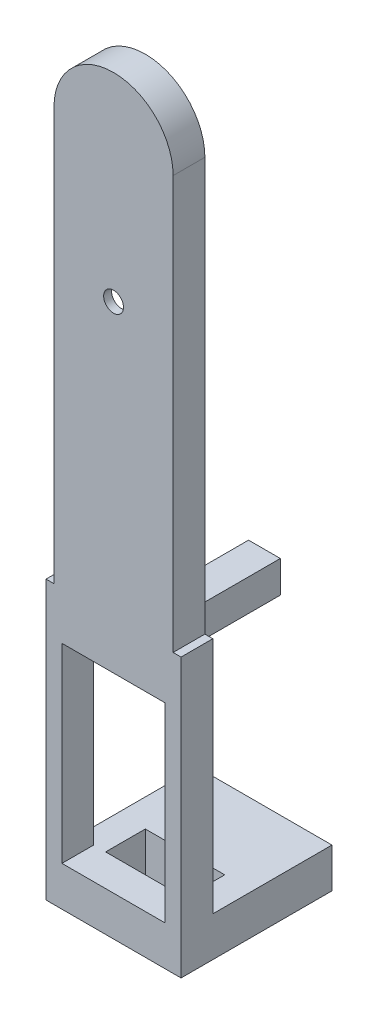
ISO-10303-21;
HEADER;
FILE_DESCRIPTION(('STEP AP214'),'2;1');
FILE_NAME('part.step','',(''),(''),'','','');
FILE_SCHEMA(('AUTOMOTIVE_DESIGN { 1 0 10303 214 1 1 1 1 }'));
ENDSEC;
DATA;
#1=APPLICATION_CONTEXT('core data for automotive mechanical design processes');
#2=APPLICATION_PROTOCOL_DEFINITION('international standard','automotive_design',2000,#1);
#3=PRODUCT_CONTEXT('',#1,'mechanical');
#4=PRODUCT('Part','Part','',(#3));
#5=PRODUCT_RELATED_PRODUCT_CATEGORY('part','',(#4));
#6=PRODUCT_DEFINITION_FORMATION('','',#4);
#7=PRODUCT_DEFINITION_CONTEXT('part definition',#1,'design');
#8=PRODUCT_DEFINITION('design','',#6,#7);
#9=PRODUCT_DEFINITION_SHAPE('','',#8);
#10=(LENGTH_UNIT() NAMED_UNIT(*) SI_UNIT(.MILLI.,.METRE.));
#11=(NAMED_UNIT(*) PLANE_ANGLE_UNIT() SI_UNIT($,.RADIAN.));
#12=(NAMED_UNIT(*) SI_UNIT($,.STERADIAN.) SOLID_ANGLE_UNIT());
#13=UNCERTAINTY_MEASURE_WITH_UNIT(LENGTH_MEASURE(1.E-05),#10,'distance_accuracy_value','');
#14=(GEOMETRIC_REPRESENTATION_CONTEXT(3) GLOBAL_UNCERTAINTY_ASSIGNED_CONTEXT((#13)) GLOBAL_UNIT_ASSIGNED_CONTEXT((#10,
#11,#12)) REPRESENTATION_CONTEXT('',''));
#15=CARTESIAN_POINT('',(0.,0.,0.));
#16=DIRECTION('',(0.,0.,1.));
#17=DIRECTION('',(1.,0.,0.));
#18=AXIS2_PLACEMENT_3D('',#15,#16,#17);
#19=CARTESIAN_POINT('',(0.,52.,0.));
#20=DIRECTION('',(0.,0.,1.));
#21=DIRECTION('',(1.,0.,0.));
#22=AXIS2_PLACEMENT_3D('',#19,#20,#21);
#23=PLANE('',#22);
#24=DIRECTION('',(1.,0.,0.));
#25=VECTOR('',#24,1.);
#26=CARTESIAN_POINT('',(-6.49999999999999,-30.,0.));
#27=LINE('',#26,#25);
#28=CARTESIAN_POINT('',(-5.,-30.,0.));
#29=VERTEX_POINT('',#28);
#30=CARTESIAN_POINT('',(5.,-30.,0.));
#31=VERTEX_POINT('',#30);
#32=EDGE_CURVE('E354',#29,#31,#27,.T.);
#33=ORIENTED_EDGE('',*,*,#32,.T.);
#34=DIRECTION('',(0.,-1.,0.));
#35=VECTOR('',#34,1.);
#36=CARTESIAN_POINT('',(5.,-30.,0.));
#37=LINE('',#36,#35);
#38=CARTESIAN_POINT('',(5.,-35.,0.));
#39=VERTEX_POINT('',#38);
#40=EDGE_CURVE('E254',#31,#39,#37,.T.);
#41=ORIENTED_EDGE('',*,*,#40,.T.);
#42=DIRECTION('',(1.,0.,0.));
#43=VECTOR('',#42,1.);
#44=CARTESIAN_POINT('',(8.50000000000001,-35.,0.));
#45=LINE('',#44,#43);
#46=CARTESIAN_POINT('',(-5.,-35.,0.));
#47=VERTEX_POINT('',#46);
#48=EDGE_CURVE('E401',#47,#39,#45,.T.);
#49=ORIENTED_EDGE('',*,*,#48,.F.);
#50=DIRECTION('',(0.,-1.,0.));
#51=VECTOR('',#50,1.);
#52=CARTESIAN_POINT('',(-5.,-30.,0.));
#53=LINE('',#52,#51);
#54=EDGE_CURVE('E294',#29,#47,#53,.T.);
#55=ORIENTED_EDGE('',*,*,#54,.F.);
#56=EDGE_LOOP('',(#33,#41,#49,#55));
#57=FACE_BOUND('',#56,.T.);
#58=ADVANCED_FACE('F41',(#57),#23,.F.);
#59=CARTESIAN_POINT('',(0.,52.,4.));
#60=DIRECTION('',(0.,0.,1.));
#61=DIRECTION('',(1.,0.,0.));
#62=AXIS2_PLACEMENT_3D('',#59,#60,#61);
#63=PLANE('',#62);
#64=CARTESIAN_POINT('',(0.,34.5,4.));
#65=DIRECTION('',(0.,0.,1.));
#66=DIRECTION('',(1.,0.,0.));
#67=AXIS2_PLACEMENT_3D('',#64,#65,#66);
#68=CIRCLE('',#67,1.25);
#69=CARTESIAN_POINT('',(1.25,34.5,4.));
#70=VERTEX_POINT('',#69);
#71=EDGE_CURVE('E439',#70,#70,#68,.F.);
#72=ORIENTED_EDGE('',*,*,#71,.T.);
#73=EDGE_LOOP('',(#72));
#74=FACE_BOUND('',#73,.T.);
#75=DIRECTION('',(0.,-1.,0.));
#76=VECTOR('',#75,1.);
#77=CARTESIAN_POINT('',(-7.5,0.,4.));
#78=LINE('',#77,#76);
#79=CARTESIAN_POINT('',(-7.5,52.,4.));
#80=VERTEX_POINT('',#79);
#81=CARTESIAN_POINT('',(-7.5,0.,4.));
#82=VERTEX_POINT('',#81);
#83=EDGE_CURVE('E513',#80,#82,#78,.T.);
#84=ORIENTED_EDGE('',*,*,#83,.T.);
#85=DIRECTION('',(-1.,0.,0.));
#86=VECTOR('',#85,1.);
#87=CARTESIAN_POINT('',(8.50000000000001,0.,4.));
#88=LINE('',#87,#86);
#89=CARTESIAN_POINT('',(-8.49999999999999,0.,4.));
#90=VERTEX_POINT('',#89);
#91=EDGE_CURVE('E400',#82,#90,#88,.T.);
#92=ORIENTED_EDGE('',*,*,#91,.T.);
#93=DIRECTION('',(0.,-1.,0.));
#94=VECTOR('',#93,1.);
#95=CARTESIAN_POINT('',(-8.49999999999999,0.,4.));
#96=LINE('',#95,#94);
#97=CARTESIAN_POINT('',(-8.49999999999999,-35.,4.));
#98=VERTEX_POINT('',#97);
#99=EDGE_CURVE('E406',#90,#98,#96,.T.);
#100=ORIENTED_EDGE('',*,*,#99,.T.);
#101=DIRECTION('',(1.,0.,0.));
#102=VECTOR('',#101,1.);
#103=CARTESIAN_POINT('',(8.50000000000001,-35.,4.));
#104=LINE('',#103,#102);
#105=CARTESIAN_POINT('',(8.50000000000001,-35.,4.));
#106=VERTEX_POINT('',#105);
#107=EDGE_CURVE('E409',#98,#106,#104,.T.);
#108=ORIENTED_EDGE('',*,*,#107,.T.);
#109=DIRECTION('',(0.,1.,0.));
#110=VECTOR('',#109,1.);
#111=CARTESIAN_POINT('',(8.50000000000001,0.,4.));
#112=LINE('',#111,#110);
#113=CARTESIAN_POINT('',(8.50000000000001,0.,4.));
#114=VERTEX_POINT('',#113);
#115=EDGE_CURVE('E396',#106,#114,#112,.T.);
#116=ORIENTED_EDGE('',*,*,#115,.T.);
#117=CARTESIAN_POINT('',(7.5,0.,4.));
#118=VERTEX_POINT('',#117);
#119=EDGE_CURVE('E402',#114,#118,#88,.T.);
#120=ORIENTED_EDGE('',*,*,#119,.T.);
#121=DIRECTION('',(0.,1.,0.));
#122=VECTOR('',#121,1.);
#123=CARTESIAN_POINT('',(7.5,0.,4.));
#124=LINE('',#123,#122);
#125=CARTESIAN_POINT('',(7.5,52.,4.));
#126=VERTEX_POINT('',#125);
#127=EDGE_CURVE('E506',#118,#126,#124,.T.);
#128=ORIENTED_EDGE('',*,*,#127,.T.);
#129=CARTESIAN_POINT('',(0.,52.,4.));
#130=DIRECTION('',(0.,0.,1.));
#131=DIRECTION('',(1.,0.,0.));
#132=AXIS2_PLACEMENT_3D('',#129,#130,#131);
#133=CIRCLE('',#132,7.5);
#134=EDGE_CURVE('E509',#126,#80,#133,.T.);
#135=ORIENTED_EDGE('',*,*,#134,.T.);
#136=EDGE_LOOP('',(#84,#92,#100,#108,#116,#120,#128,#135));
#137=FACE_BOUND('',#136,.T.);
#138=DIRECTION('',(-1.,0.,0.));
#139=VECTOR('',#138,1.);
#140=CARTESIAN_POINT('',(0.,-30.,4.));
#141=LINE('',#140,#139);
#142=CARTESIAN_POINT('',(6.50000000000001,-30.,4.));
#143=VERTEX_POINT('',#142);
#144=CARTESIAN_POINT('',(-6.49999999999999,-30.,4.));
#145=VERTEX_POINT('',#144);
#146=EDGE_CURVE('E388',#143,#145,#141,.T.);
#147=ORIENTED_EDGE('',*,*,#146,.T.);
#148=DIRECTION('',(0.,1.,0.));
#149=VECTOR('',#148,1.);
#150=CARTESIAN_POINT('',(-6.5,52.,4.));
#151=LINE('',#150,#149);
#152=CARTESIAN_POINT('',(-6.49999999999999,-6.,4.));
#153=VERTEX_POINT('',#152);
#154=EDGE_CURVE('E392',#145,#153,#151,.T.);
#155=ORIENTED_EDGE('',*,*,#154,.T.);
#156=DIRECTION('',(1.,0.,0.));
#157=VECTOR('',#156,1.);
#158=CARTESIAN_POINT('',(0.,-6.,4.));
#159=LINE('',#158,#157);
#160=CARTESIAN_POINT('',(6.50000000000001,-6.,4.));
#161=VERTEX_POINT('',#160);
#162=EDGE_CURVE('E380',#153,#161,#159,.T.);
#163=ORIENTED_EDGE('',*,*,#162,.T.);
#164=DIRECTION('',(0.,-1.,0.));
#165=VECTOR('',#164,1.);
#166=CARTESIAN_POINT('',(6.5,52.,4.));
#167=LINE('',#166,#165);
#168=EDGE_CURVE('E384',#161,#143,#167,.T.);
#169=ORIENTED_EDGE('',*,*,#168,.T.);
#170=EDGE_LOOP('',(#147,#155,#163,#169));
#171=FACE_BOUND('',#170,.T.);
#172=ADVANCED_FACE('F556',(#74,#137,#171),#63,.T.);
#173=DIRECTION('',(-0.161684528353418,0.986842496699009,0.));
#174=VECTOR('',#173,1.);
#175=CARTESIAN_POINT('',(10.3740127119628,1.69968090964537,0.));
#176=LINE('',#175,#174);
#177=CARTESIAN_POINT('',(5.,34.5,0.));
#178=VERTEX_POINT('',#177);
#179=CARTESIAN_POINT('',(2.13279550115704,52.,0.));
#180=VERTEX_POINT('',#179);
#181=EDGE_CURVE('E449',#178,#180,#176,.T.);
#182=ORIENTED_EDGE('',*,*,#181,.T.);
#183=CARTESIAN_POINT('',(0.,52.,0.));
#184=DIRECTION('',(0.,0.,1.));
#185=DIRECTION('',(1.,0.,0.));
#186=AXIS2_PLACEMENT_3D('',#183,#184,#185);
#187=CIRCLE('',#186,2.13279550115703);
#188=CARTESIAN_POINT('',(-2.13279550115703,52.,0.));
#189=VERTEX_POINT('',#188);
#190=EDGE_CURVE('E443',#189,#180,#187,.F.);
#191=ORIENTED_EDGE('',*,*,#190,.F.);
#192=DIRECTION('',(-0.161684528353418,-0.986842496699009,0.));
#193=VECTOR('',#192,1.);
#194=CARTESIAN_POINT('',(-10.3740127119628,1.69968090964537,0.));
#195=LINE('',#194,#193);
#196=CARTESIAN_POINT('',(-5.,34.5,0.));
#197=VERTEX_POINT('',#196);
#198=EDGE_CURVE('E468',#189,#197,#195,.T.);
#199=ORIENTED_EDGE('',*,*,#198,.T.);
#200=DIRECTION('',(0.161167236733303,-0.986927110684346,0.));
#201=VECTOR('',#200,1.);
#202=CARTESIAN_POINT('',(0.617455268354402,0.100831721339679,0.));
#203=LINE('',#202,#201);
#204=CARTESIAN_POINT('',(-2.14221383494361,17.,0.));
#205=VERTEX_POINT('',#204);
#206=EDGE_CURVE('E472',#197,#205,#203,.T.);
#207=ORIENTED_EDGE('',*,*,#206,.T.);
#208=CARTESIAN_POINT('',(0.,17.,0.));
#209=DIRECTION('',(0.,0.,1.));
#210=DIRECTION('',(1.,0.,0.));
#211=AXIS2_PLACEMENT_3D('',#208,#209,#210);
#212=CIRCLE('',#211,2.14221383494361);
#213=CARTESIAN_POINT('',(2.11474128897981,16.6580213525557,0.));
#214=VERTEX_POINT('',#213);
#215=EDGE_CURVE('E476',#205,#214,#212,.T.);
#216=ORIENTED_EDGE('',*,*,#215,.T.);
#217=DIRECTION('',(-0.159637960443524,-0.987175628541057,0.));
#218=VECTOR('',#217,1.);
#219=CARTESIAN_POINT('',(-0.564300677997616,0.091254085603361,0.));
#220=LINE('',#219,#218);
#221=EDGE_CURVE('E480',#178,#214,#220,.T.);
#222=ORIENTED_EDGE('',*,*,#221,.F.);
#223=EDGE_LOOP('',(#182,#191,#199,#207,#216,#222));
#224=FACE_BOUND('',#223,.T.);
#225=DIRECTION('',(0.,1.,0.));
#226=VECTOR('',#225,1.);
#227=CARTESIAN_POINT('',(8.50000000000001,0.,0.));
#228=LINE('',#227,#226);
#229=CARTESIAN_POINT('',(8.50000000000001,-30.,0.));
#230=VERTEX_POINT('',#229);
#231=CARTESIAN_POINT('',(8.50000000000001,0.,0.));
#232=VERTEX_POINT('',#231);
#233=EDGE_CURVE('E59',#230,#232,#228,.T.);
#234=ORIENTED_EDGE('',*,*,#233,.F.);
#235=DIRECTION('',(1.,0.,0.));
#236=VECTOR('',#235,1.);
#237=CARTESIAN_POINT('',(0.,-30.,0.));
#238=LINE('',#237,#236);
#239=CARTESIAN_POINT('',(6.50000000000001,-30.,0.));
#240=VERTEX_POINT('',#239);
#241=EDGE_CURVE('E259',#240,#230,#238,.T.);
#242=ORIENTED_EDGE('',*,*,#241,.F.);
#243=DIRECTION('',(0.,1.,0.));
#244=VECTOR('',#243,1.);
#245=CARTESIAN_POINT('',(6.50000000000001,-6.,0.));
#246=LINE('',#245,#244);
#247=CARTESIAN_POINT('',(6.50000000000001,-6.,0.));
#248=VERTEX_POINT('',#247);
#249=EDGE_CURVE('E357',#240,#248,#246,.T.);
#250=ORIENTED_EDGE('',*,*,#249,.T.);
#251=DIRECTION('',(-1.,0.,0.));
#252=VECTOR('',#251,1.);
#253=CARTESIAN_POINT('',(-6.49999999999999,-6.,0.));
#254=LINE('',#253,#252);
#255=CARTESIAN_POINT('',(2.00000000000001,-6.00000000000001,0.));
#256=VERTEX_POINT('',#255);
#257=EDGE_CURVE('E362',#248,#256,#254,.T.);
#258=ORIENTED_EDGE('',*,*,#257,.T.);
#259=DIRECTION('',(0.,1.,0.));
#260=VECTOR('',#259,1.);
#261=CARTESIAN_POINT('',(2.00000000000001,-2.00000000000001,0.));
#262=LINE('',#261,#260);
#263=CARTESIAN_POINT('',(2.00000000000001,-2.00000000000001,0.));
#264=VERTEX_POINT('',#263);
#265=EDGE_CURVE('E310',#256,#264,#262,.T.);
#266=ORIENTED_EDGE('',*,*,#265,.T.);
#267=DIRECTION('',(-1.,0.,0.));
#268=VECTOR('',#267,1.);
#269=CARTESIAN_POINT('',(2.00000000000001,-2.00000000000001,0.));
#270=LINE('',#269,#268);
#271=CARTESIAN_POINT('',(-1.99999999999999,-2.00000000000001,0.));
#272=VERTEX_POINT('',#271);
#273=EDGE_CURVE('E333',#264,#272,#270,.T.);
#274=ORIENTED_EDGE('',*,*,#273,.T.);
#275=DIRECTION('',(0.,-1.,0.));
#276=VECTOR('',#275,1.);
#277=CARTESIAN_POINT('',(-1.99999999999999,-2.00000000000001,0.));
#278=LINE('',#277,#276);
#279=CARTESIAN_POINT('',(-1.99999999999999,-6.,0.));
#280=VERTEX_POINT('',#279);
#281=EDGE_CURVE('E317',#272,#280,#278,.T.);
#282=ORIENTED_EDGE('',*,*,#281,.T.);
#283=CARTESIAN_POINT('',(-6.49999999999999,-6.,0.));
#284=VERTEX_POINT('',#283);
#285=EDGE_CURVE('E361',#280,#284,#254,.T.);
#286=ORIENTED_EDGE('',*,*,#285,.T.);
#287=DIRECTION('',(0.,-1.,0.));
#288=VECTOR('',#287,1.);
#289=CARTESIAN_POINT('',(-6.49999999999999,-6.,0.));
#290=LINE('',#289,#288);
#291=CARTESIAN_POINT('',(-6.49999999999999,-30.,0.));
#292=VERTEX_POINT('',#291);
#293=EDGE_CURVE('E343',#284,#292,#290,.T.);
#294=ORIENTED_EDGE('',*,*,#293,.T.);
#295=DIRECTION('',(1.,0.,0.));
#296=VECTOR('',#295,1.);
#297=CARTESIAN_POINT('',(0.,-30.,0.));
#298=LINE('',#297,#296);
#299=CARTESIAN_POINT('',(-8.49999999999999,-30.,0.));
#300=VERTEX_POINT('',#299);
#301=EDGE_CURVE('E66',#300,#292,#298,.T.);
#302=ORIENTED_EDGE('',*,*,#301,.F.);
#303=DIRECTION('',(0.,-1.,0.));
#304=VECTOR('',#303,1.);
#305=CARTESIAN_POINT('',(-8.49999999999999,0.,0.));
#306=LINE('',#305,#304);
#307=CARTESIAN_POINT('',(-8.49999999999999,0.,0.));
#308=VERTEX_POINT('',#307);
#309=EDGE_CURVE('E420',#308,#300,#306,.T.);
#310=ORIENTED_EDGE('',*,*,#309,.F.);
#311=DIRECTION('',(-1.,0.,0.));
#312=VECTOR('',#311,1.);
#313=CARTESIAN_POINT('',(8.50000000000001,0.,0.));
#314=LINE('',#313,#312);
#315=CARTESIAN_POINT('',(-7.5,0.,0.));
#316=VERTEX_POINT('',#315);
#317=EDGE_CURVE('E415',#316,#308,#314,.T.);
#318=ORIENTED_EDGE('',*,*,#317,.F.);
#319=DIRECTION('',(0.,-1.,0.));
#320=VECTOR('',#319,1.);
#321=CARTESIAN_POINT('',(-7.5,0.,0.));
#322=LINE('',#321,#320);
#323=CARTESIAN_POINT('',(-7.5,52.,0.));
#324=VERTEX_POINT('',#323);
#325=EDGE_CURVE('E510',#324,#316,#322,.T.);
#326=ORIENTED_EDGE('',*,*,#325,.F.);
#327=CARTESIAN_POINT('',(0.,52.,0.));
#328=DIRECTION('',(0.,0.,1.));
#329=DIRECTION('',(1.,0.,0.));
#330=AXIS2_PLACEMENT_3D('',#327,#328,#329);
#331=CIRCLE('',#330,7.5);
#332=CARTESIAN_POINT('',(7.5,52.,0.));
#333=VERTEX_POINT('',#332);
#334=EDGE_CURVE('E519',#333,#324,#331,.T.);
#335=ORIENTED_EDGE('',*,*,#334,.F.);
#336=DIRECTION('',(0.,1.,0.));
#337=VECTOR('',#336,1.);
#338=CARTESIAN_POINT('',(7.5,0.,0.));
#339=LINE('',#338,#337);
#340=CARTESIAN_POINT('',(7.5,0.,0.));
#341=VERTEX_POINT('',#340);
#342=EDGE_CURVE('E505',#341,#333,#339,.T.);
#343=ORIENTED_EDGE('',*,*,#342,.F.);
#344=EDGE_CURVE('E416',#232,#341,#314,.T.);
#345=ORIENTED_EDGE('',*,*,#344,.F.);
#346=EDGE_LOOP('',(#234,#242,#250,#258,#266,#274,#282,#286,#294,#302,#310,#318,#326,#335,#343,#345));
#347=FACE_BOUND('',#346,.T.);
#348=ADVANCED_FACE('F542',(#224,#347),#23,.F.);
#349=CARTESIAN_POINT('',(7.5,0.,4.));
#350=DIRECTION('',(-1.,0.,0.));
#351=DIRECTION('',(0.,0.,1.));
#352=AXIS2_PLACEMENT_3D('',#349,#350,#351);
#353=PLANE('',#352);
#354=ORIENTED_EDGE('',*,*,#342,.T.);
#355=DIRECTION('',(0.,0.,-1.));
#356=VECTOR('',#355,1.);
#357=CARTESIAN_POINT('',(7.5,52.,4.));
#358=LINE('',#357,#356);
#359=EDGE_CURVE('E531',#126,#333,#358,.T.);
#360=ORIENTED_EDGE('',*,*,#359,.F.);
#361=ORIENTED_EDGE('',*,*,#127,.F.);
#362=DIRECTION('',(0.,0.,-1.));
#363=VECTOR('',#362,1.);
#364=CARTESIAN_POINT('',(7.5,0.,4.));
#365=LINE('',#364,#363);
#366=EDGE_CURVE('E51',#118,#341,#365,.T.);
#367=ORIENTED_EDGE('',*,*,#366,.T.);
#368=EDGE_LOOP('',(#354,#360,#361,#367));
#369=FACE_BOUND('',#368,.T.);
#370=ADVANCED_FACE('F43',(#369),#353,.F.);
#371=CARTESIAN_POINT('',(0.,52.,4.));
#372=DIRECTION('',(0.,0.,-1.));
#373=DIRECTION('',(-1.,0.,0.));
#374=AXIS2_PLACEMENT_3D('',#371,#372,#373);
#375=CYLINDRICAL_SURFACE('',#374,7.5);
#376=ORIENTED_EDGE('',*,*,#334,.T.);
#377=DIRECTION('',(0.,0.,-1.));
#378=VECTOR('',#377,1.);
#379=CARTESIAN_POINT('',(-7.5,52.,4.));
#380=LINE('',#379,#378);
#381=EDGE_CURVE('E527',#80,#324,#380,.T.);
#382=ORIENTED_EDGE('',*,*,#381,.F.);
#383=ORIENTED_EDGE('',*,*,#134,.F.);
#384=ORIENTED_EDGE('',*,*,#359,.T.);
#385=EDGE_LOOP('',(#376,#382,#383,#384));
#386=FACE_BOUND('',#385,.T.);
#387=ADVANCED_FACE('F548',(#386),#375,.T.);
#388=CARTESIAN_POINT('',(-7.5,0.,4.));
#389=DIRECTION('',(1.,0.,0.));
#390=DIRECTION('',(0.,0.,-1.));
#391=AXIS2_PLACEMENT_3D('',#388,#389,#390);
#392=PLANE('',#391);
#393=ORIENTED_EDGE('',*,*,#325,.T.);
#394=DIRECTION('',(0.,0.,-1.));
#395=VECTOR('',#394,1.);
#396=CARTESIAN_POINT('',(-7.5,0.,4.));
#397=LINE('',#396,#395);
#398=EDGE_CURVE('E516',#82,#316,#397,.T.);
#399=ORIENTED_EDGE('',*,*,#398,.F.);
#400=ORIENTED_EDGE('',*,*,#83,.F.);
#401=ORIENTED_EDGE('',*,*,#381,.T.);
#402=EDGE_LOOP('',(#393,#399,#400,#401));
#403=FACE_BOUND('',#402,.T.);
#404=ADVANCED_FACE('F552',(#403),#392,.F.);
#405=CARTESIAN_POINT('',(0.,52.,3.));
#406=DIRECTION('',(0.,0.,-1.));
#407=DIRECTION('',(-1.,0.,0.));
#408=AXIS2_PLACEMENT_3D('',#405,#406,#407);
#409=CYLINDRICAL_SURFACE('',#408,2.13279550115703);
#410=ORIENTED_EDGE('',*,*,#190,.T.);
#411=DIRECTION('',(0.,0.,-1.));
#412=VECTOR('',#411,1.);
#413=CARTESIAN_POINT('',(2.13279550115704,52.,3.));
#414=LINE('',#413,#412);
#415=CARTESIAN_POINT('',(2.13279550115704,52.,3.));
#416=VERTEX_POINT('',#415);
#417=EDGE_CURVE('E465',#416,#180,#414,.T.);
#418=ORIENTED_EDGE('',*,*,#417,.F.);
#419=CARTESIAN_POINT('',(0.,52.,3.));
#420=DIRECTION('',(0.,0.,1.));
#421=DIRECTION('',(1.,0.,0.));
#422=AXIS2_PLACEMENT_3D('',#419,#420,#421);
#423=CIRCLE('',#422,2.13279550115703);
#424=CARTESIAN_POINT('',(-2.13279550115703,52.,3.));
#425=VERTEX_POINT('',#424);
#426=EDGE_CURVE('E444',#425,#416,#423,.F.);
#427=ORIENTED_EDGE('',*,*,#426,.F.);
#428=DIRECTION('',(0.,0.,-1.));
#429=VECTOR('',#428,1.);
#430=CARTESIAN_POINT('',(-2.13279550115703,52.,3.));
#431=LINE('',#430,#429);
#432=EDGE_CURVE('E502',#425,#189,#431,.T.);
#433=ORIENTED_EDGE('',*,*,#432,.T.);
#434=EDGE_LOOP('',(#410,#418,#427,#433));
#435=FACE_BOUND('',#434,.T.);
#436=ADVANCED_FACE('F613',(#435),#409,.F.);
#437=CARTESIAN_POINT('',(-10.3740127119628,1.69968090964537,3.));
#438=DIRECTION('',(0.986842496699008,-0.161684528353418,0.));
#439=DIRECTION('',(0.161684528353418,0.986842496699009,0.));
#440=AXIS2_PLACEMENT_3D('',#437,#438,#439);
#441=PLANE('',#440);
#442=ORIENTED_EDGE('',*,*,#198,.F.);
#443=ORIENTED_EDGE('',*,*,#432,.F.);
#444=DIRECTION('',(-0.161684528353418,-0.986842496699009,0.));
#445=VECTOR('',#444,1.);
#446=CARTESIAN_POINT('',(-10.3740127119628,1.69968090964537,3.));
#447=LINE('',#446,#445);
#448=CARTESIAN_POINT('',(-5.,34.5,3.));
#449=VERTEX_POINT('',#448);
#450=EDGE_CURVE('E448',#425,#449,#447,.T.);
#451=ORIENTED_EDGE('',*,*,#450,.T.);
#452=DIRECTION('',(0.,0.,-1.));
#453=VECTOR('',#452,1.);
#454=CARTESIAN_POINT('',(-5.,34.5,3.));
#455=LINE('',#454,#453);
#456=EDGE_CURVE('E499',#449,#197,#455,.T.);
#457=ORIENTED_EDGE('',*,*,#456,.T.);
#458=EDGE_LOOP('',(#442,#443,#451,#457));
#459=FACE_BOUND('',#458,.T.);
#460=ADVANCED_FACE('F633',(#459),#441,.T.);
#461=CARTESIAN_POINT('',(0.617455268354402,0.100831721339679,3.));
#462=DIRECTION('',(0.986927110684346,0.161167236733303,0.));
#463=DIRECTION('',(-0.161167236733303,0.986927110684346,0.));
#464=AXIS2_PLACEMENT_3D('',#461,#462,#463);
#465=PLANE('',#464);
#466=ORIENTED_EDGE('',*,*,#206,.F.);
#467=ORIENTED_EDGE('',*,*,#456,.F.);
#468=DIRECTION('',(0.161167236733303,-0.986927110684346,0.));
#469=VECTOR('',#468,1.);
#470=CARTESIAN_POINT('',(0.617455268354402,0.100831721339679,3.));
#471=LINE('',#470,#469);
#472=CARTESIAN_POINT('',(-2.14221383494361,17.,3.));
#473=VERTEX_POINT('',#472);
#474=EDGE_CURVE('E452',#449,#473,#471,.T.);
#475=ORIENTED_EDGE('',*,*,#474,.T.);
#476=DIRECTION('',(0.,0.,-1.));
#477=VECTOR('',#476,1.);
#478=CARTESIAN_POINT('',(-2.14221383494361,17.,3.));
#479=LINE('',#478,#477);
#480=EDGE_CURVE('E496',#473,#205,#479,.T.);
#481=ORIENTED_EDGE('',*,*,#480,.T.);
#482=EDGE_LOOP('',(#466,#467,#475,#481));
#483=FACE_BOUND('',#482,.T.);
#484=ADVANCED_FACE('F630',(#483),#465,.T.);
#485=CARTESIAN_POINT('',(0.,17.,3.));
#486=DIRECTION('',(0.,0.,-1.));
#487=DIRECTION('',(-1.,0.,0.));
#488=AXIS2_PLACEMENT_3D('',#485,#486,#487);
#489=CYLINDRICAL_SURFACE('',#488,2.14221383494361);
#490=ORIENTED_EDGE('',*,*,#215,.F.);
#491=ORIENTED_EDGE('',*,*,#480,.F.);
#492=CARTESIAN_POINT('',(0.,17.,3.));
#493=DIRECTION('',(0.,0.,1.));
#494=DIRECTION('',(1.,0.,0.));
#495=AXIS2_PLACEMENT_3D('',#492,#493,#494);
#496=CIRCLE('',#495,2.14221383494361);
#497=CARTESIAN_POINT('',(2.11474128897981,16.6580213525557,3.));
#498=VERTEX_POINT('',#497);
#499=EDGE_CURVE('E455',#473,#498,#496,.T.);
#500=ORIENTED_EDGE('',*,*,#499,.T.);
#501=DIRECTION('',(0.,0.,-1.));
#502=VECTOR('',#501,1.);
#503=CARTESIAN_POINT('',(2.11474128897981,16.6580213525557,3.));
#504=LINE('',#503,#502);
#505=EDGE_CURVE('E493',#498,#214,#504,.T.);
#506=ORIENTED_EDGE('',*,*,#505,.T.);
#507=EDGE_LOOP('',(#490,#491,#500,#506));
#508=FACE_BOUND('',#507,.T.);
#509=ADVANCED_FACE('F627',(#508),#489,.F.);
#510=CARTESIAN_POINT('',(-0.564300677997616,0.091254085603361,3.));
#511=DIRECTION('',(0.987175628541057,-0.159637960443524,0.));
#512=DIRECTION('',(0.159637960443524,0.987175628541057,0.));
#513=AXIS2_PLACEMENT_3D('',#510,#511,#512);
#514=PLANE('',#513);
#515=ORIENTED_EDGE('',*,*,#221,.T.);
#516=ORIENTED_EDGE('',*,*,#505,.F.);
#517=DIRECTION('',(-0.159637960443524,-0.987175628541057,0.));
#518=VECTOR('',#517,1.);
#519=CARTESIAN_POINT('',(-0.564300677997616,0.091254085603361,3.));
#520=LINE('',#519,#518);
#521=CARTESIAN_POINT('',(5.,34.5,3.));
#522=VERTEX_POINT('',#521);
#523=EDGE_CURVE('E458',#522,#498,#520,.T.);
#524=ORIENTED_EDGE('',*,*,#523,.F.);
#525=DIRECTION('',(0.,0.,-1.));
#526=VECTOR('',#525,1.);
#527=CARTESIAN_POINT('',(5.,34.5,3.));
#528=LINE('',#527,#526);
#529=EDGE_CURVE('E490',#522,#178,#528,.T.);
#530=ORIENTED_EDGE('',*,*,#529,.T.);
#531=EDGE_LOOP('',(#515,#516,#524,#530));
#532=FACE_BOUND('',#531,.T.);
#533=ADVANCED_FACE('F623',(#532),#514,.F.);
#534=CARTESIAN_POINT('',(10.3740127119628,1.69968090964537,3.));
#535=DIRECTION('',(-0.986842496699008,-0.161684528353418,0.));
#536=DIRECTION('',(0.161684528353418,-0.986842496699009,0.));
#537=AXIS2_PLACEMENT_3D('',#534,#535,#536);
#538=PLANE('',#537);
#539=ORIENTED_EDGE('',*,*,#181,.F.);
#540=ORIENTED_EDGE('',*,*,#529,.F.);
#541=DIRECTION('',(-0.161684528353418,0.986842496699009,0.));
#542=VECTOR('',#541,1.);
#543=CARTESIAN_POINT('',(10.3740127119628,1.69968090964537,3.));
#544=LINE('',#543,#542);
#545=EDGE_CURVE('E462',#522,#416,#544,.T.);
#546=ORIENTED_EDGE('',*,*,#545,.T.);
#547=ORIENTED_EDGE('',*,*,#417,.T.);
#548=EDGE_LOOP('',(#539,#540,#546,#547));
#549=FACE_BOUND('',#548,.T.);
#550=ADVANCED_FACE('F604',(#549),#538,.T.);
#551=CARTESIAN_POINT('',(0.,0.,3.));
#552=DIRECTION('',(0.,0.,1.));
#553=DIRECTION('',(1.,0.,0.));
#554=AXIS2_PLACEMENT_3D('',#551,#552,#553);
#555=PLANE('',#554);
#556=CARTESIAN_POINT('',(0.,34.5,3.));
#557=DIRECTION('',(0.,0.,1.));
#558=DIRECTION('',(1.,0.,0.));
#559=AXIS2_PLACEMENT_3D('',#556,#557,#558);
#560=CIRCLE('',#559,1.25);
#561=CARTESIAN_POINT('',(1.25,34.5,3.));
#562=VERTEX_POINT('',#561);
#563=EDGE_CURVE('E45',#562,#562,#560,.F.);
#564=ORIENTED_EDGE('',*,*,#563,.F.);
#565=EDGE_LOOP('',(#564));
#566=FACE_BOUND('',#565,.T.);
#567=ORIENTED_EDGE('',*,*,#426,.T.);
#568=ORIENTED_EDGE('',*,*,#545,.F.);
#569=ORIENTED_EDGE('',*,*,#523,.T.);
#570=ORIENTED_EDGE('',*,*,#499,.F.);
#571=ORIENTED_EDGE('',*,*,#474,.F.);
#572=ORIENTED_EDGE('',*,*,#450,.F.);
#573=EDGE_LOOP('',(#567,#568,#569,#570,#571,#572));
#574=FACE_BOUND('',#573,.T.);
#575=ADVANCED_FACE('F601',(#566,#574),#555,.F.);
#576=CARTESIAN_POINT('',(0.,34.5,12.4));
#577=DIRECTION('',(0.,0.,-1.));
#578=DIRECTION('',(-1.,0.,0.));
#579=AXIS2_PLACEMENT_3D('',#576,#577,#578);
#580=CYLINDRICAL_SURFACE('',#579,1.25);
#581=ORIENTED_EDGE('',*,*,#71,.F.);
#582=EDGE_LOOP('',(#581));
#583=FACE_BOUND('',#582,.T.);
#584=ORIENTED_EDGE('',*,*,#563,.T.);
#585=EDGE_LOOP('',(#584));
#586=FACE_BOUND('',#585,.T.);
#587=ADVANCED_FACE('F599',(#583,#586),#580,.F.);
#588=CARTESIAN_POINT('',(8.50000000000001,0.,4.));
#589=DIRECTION('',(0.,-1.,0.));
#590=DIRECTION('',(1.,0.,0.));
#591=AXIS2_PLACEMENT_3D('',#588,#589,#590);
#592=PLANE('',#591);
#593=ORIENTED_EDGE('',*,*,#91,.F.);
#594=ORIENTED_EDGE('',*,*,#398,.T.);
#595=ORIENTED_EDGE('',*,*,#317,.T.);
#596=DIRECTION('',(0.,0.,-1.));
#597=VECTOR('',#596,1.);
#598=CARTESIAN_POINT('',(-8.49999999999999,0.,4.));
#599=LINE('',#598,#597);
#600=EDGE_CURVE('E431',#90,#308,#599,.T.);
#601=ORIENTED_EDGE('',*,*,#600,.F.);
#602=EDGE_LOOP('',(#593,#594,#595,#601));
#603=FACE_BOUND('',#602,.T.);
#604=ADVANCED_FACE('F722',(#603),#592,.F.);
#605=CARTESIAN_POINT('',(8.50000000000001,0.,4.));
#606=DIRECTION('',(-1.,0.,0.));
#607=DIRECTION('',(0.,-1.,0.));
#608=AXIS2_PLACEMENT_3D('',#605,#606,#607);
#609=PLANE('',#608);
#610=DIRECTION('',(0.,0.,-1.));
#611=VECTOR('',#610,1.);
#612=CARTESIAN_POINT('',(8.50000000000001,-35.,4.));
#613=LINE('',#612,#611);
#614=CARTESIAN_POINT('',(8.50000000000001,-35.,-15.));
#615=VERTEX_POINT('',#614);
#616=EDGE_CURVE('E412',#106,#615,#613,.T.);
#617=ORIENTED_EDGE('',*,*,#616,.T.);
#618=DIRECTION('',(0.,-1.,0.));
#619=VECTOR('',#618,1.);
#620=CARTESIAN_POINT('',(8.50000000000001,-30.,-15.));
#621=LINE('',#620,#619);
#622=CARTESIAN_POINT('',(8.50000000000001,-30.,-15.));
#623=VERTEX_POINT('',#622);
#624=EDGE_CURVE('E302',#623,#615,#621,.T.);
#625=ORIENTED_EDGE('',*,*,#624,.F.);
#626=DIRECTION('',(0.,0.,-1.));
#627=VECTOR('',#626,1.);
#628=CARTESIAN_POINT('',(8.50000000000001,-30.,0.));
#629=LINE('',#628,#627);
#630=EDGE_CURVE('E262',#230,#623,#629,.T.);
#631=ORIENTED_EDGE('',*,*,#630,.F.);
#632=ORIENTED_EDGE('',*,*,#233,.T.);
#633=DIRECTION('',(0.,0.,-1.));
#634=VECTOR('',#633,1.);
#635=CARTESIAN_POINT('',(8.50000000000001,0.,4.));
#636=LINE('',#635,#634);
#637=EDGE_CURVE('E435',#114,#232,#636,.T.);
#638=ORIENTED_EDGE('',*,*,#637,.F.);
#639=ORIENTED_EDGE('',*,*,#115,.F.);
#640=EDGE_LOOP('',(#617,#625,#631,#632,#638,#639));
#641=FACE_BOUND('',#640,.T.);
#642=ADVANCED_FACE('F563',(#641),#609,.F.);
#643=ORIENTED_EDGE('',*,*,#366,.F.);
#644=ORIENTED_EDGE('',*,*,#119,.F.);
#645=ORIENTED_EDGE('',*,*,#637,.T.);
#646=ORIENTED_EDGE('',*,*,#344,.T.);
#647=EDGE_LOOP('',(#643,#644,#645,#646));
#648=FACE_BOUND('',#647,.T.);
#649=ADVANCED_FACE('F540',(#648),#592,.F.);
#650=CARTESIAN_POINT('',(-8.49999999999999,0.,4.));
#651=DIRECTION('',(1.,0.,0.));
#652=DIRECTION('',(0.,1.,0.));
#653=AXIS2_PLACEMENT_3D('',#650,#651,#652);
#654=PLANE('',#653);
#655=ORIENTED_EDGE('',*,*,#309,.T.);
#656=DIRECTION('',(0.,0.,1.));
#657=VECTOR('',#656,1.);
#658=CARTESIAN_POINT('',(-8.50000000000001,-30.,0.));
#659=LINE('',#658,#657);
#660=CARTESIAN_POINT('',(-8.50000000000001,-30.,-15.));
#661=VERTEX_POINT('',#660);
#662=EDGE_CURVE('E271',#661,#300,#659,.T.);
#663=ORIENTED_EDGE('',*,*,#662,.F.);
#664=DIRECTION('',(0.,-1.,0.));
#665=VECTOR('',#664,1.);
#666=CARTESIAN_POINT('',(-8.50000000000001,-30.,-15.));
#667=LINE('',#666,#665);
#668=CARTESIAN_POINT('',(-8.50000000000001,-35.,-15.));
#669=VERTEX_POINT('',#668);
#670=EDGE_CURVE('E298',#661,#669,#667,.T.);
#671=ORIENTED_EDGE('',*,*,#670,.T.);
#672=DIRECTION('',(0.,0.,-1.));
#673=VECTOR('',#672,1.);
#674=CARTESIAN_POINT('',(-8.49999999999999,-35.,4.));
#675=LINE('',#674,#673);
#676=EDGE_CURVE('E428',#98,#669,#675,.T.);
#677=ORIENTED_EDGE('',*,*,#676,.F.);
#678=ORIENTED_EDGE('',*,*,#99,.F.);
#679=ORIENTED_EDGE('',*,*,#600,.T.);
#680=EDGE_LOOP('',(#655,#663,#671,#677,#678,#679));
#681=FACE_BOUND('',#680,.T.);
#682=ADVANCED_FACE('F753',(#681),#654,.F.);
#683=CARTESIAN_POINT('',(8.50000000000001,-35.,4.));
#684=DIRECTION('',(0.,1.,0.));
#685=DIRECTION('',(0.,0.,1.));
#686=AXIS2_PLACEMENT_3D('',#683,#684,#685);
#687=PLANE('',#686);
#688=DIRECTION('',(-1.,0.,0.));
#689=VECTOR('',#688,1.);
#690=CARTESIAN_POINT('',(0.,-35.,-15.));
#691=LINE('',#690,#689);
#692=EDGE_CURVE('E286',#615,#669,#691,.T.);
#693=ORIENTED_EDGE('',*,*,#692,.F.);
#694=ORIENTED_EDGE('',*,*,#616,.F.);
#695=ORIENTED_EDGE('',*,*,#107,.F.);
#696=ORIENTED_EDGE('',*,*,#676,.T.);
#697=EDGE_LOOP('',(#693,#694,#695,#696));
#698=FACE_BOUND('',#697,.T.);
#699=ORIENTED_EDGE('',*,*,#48,.T.);
#700=DIRECTION('',(0.,0.,-1.));
#701=VECTOR('',#700,1.);
#702=CARTESIAN_POINT('',(5.,-35.,0.));
#703=LINE('',#702,#701);
#704=CARTESIAN_POINT('',(5.,-35.,-5.));
#705=VERTEX_POINT('',#704);
#706=EDGE_CURVE('E282',#39,#705,#703,.T.);
#707=ORIENTED_EDGE('',*,*,#706,.T.);
#708=DIRECTION('',(1.,0.,0.));
#709=VECTOR('',#708,1.);
#710=CARTESIAN_POINT('',(0.,-35.,-5.));
#711=LINE('',#710,#709);
#712=CARTESIAN_POINT('',(-5.,-35.,-5.));
#713=VERTEX_POINT('',#712);
#714=EDGE_CURVE('E248',#713,#705,#711,.T.);
#715=ORIENTED_EDGE('',*,*,#714,.F.);
#716=DIRECTION('',(0.,0.,-1.));
#717=VECTOR('',#716,1.);
#718=CARTESIAN_POINT('',(-5.,-35.,0.));
#719=LINE('',#718,#717);
#720=EDGE_CURVE('E242',#47,#713,#719,.T.);
#721=ORIENTED_EDGE('',*,*,#720,.F.);
#722=EDGE_LOOP('',(#699,#707,#715,#721));
#723=FACE_BOUND('',#722,.T.);
#724=ADVANCED_FACE('F759',(#698,#723),#687,.F.);
#725=CARTESIAN_POINT('',(-6.49999999999999,-6.,12.1));
#726=DIRECTION('',(1.,0.,0.));
#727=DIRECTION('',(0.,1.,0.));
#728=AXIS2_PLACEMENT_3D('',#725,#726,#727);
#729=PLANE('',#728);
#730=DIRECTION('',(0.,0.,-1.));
#731=VECTOR('',#730,1.);
#732=CARTESIAN_POINT('',(-6.49999999999999,-30.,12.1));
#733=LINE('',#732,#731);
#734=EDGE_CURVE('E377',#145,#292,#733,.T.);
#735=ORIENTED_EDGE('',*,*,#734,.T.);
#736=ORIENTED_EDGE('',*,*,#293,.F.);
#737=DIRECTION('',(0.,0.,-1.));
#738=VECTOR('',#737,1.);
#739=CARTESIAN_POINT('',(-6.49999999999999,-6.,12.1));
#740=LINE('',#739,#738);
#741=EDGE_CURVE('E366',#153,#284,#740,.T.);
#742=ORIENTED_EDGE('',*,*,#741,.F.);
#743=ORIENTED_EDGE('',*,*,#154,.F.);
#744=EDGE_LOOP('',(#735,#736,#742,#743));
#745=FACE_BOUND('',#744,.T.);
#746=ADVANCED_FACE('F767',(#745),#729,.T.);
#747=CARTESIAN_POINT('',(-6.49999999999999,-30.,12.1));
#748=DIRECTION('',(0.,1.,0.));
#749=DIRECTION('',(0.,0.,1.));
#750=AXIS2_PLACEMENT_3D('',#747,#748,#749);
#751=PLANE('',#750);
#752=DIRECTION('',(0.,0.,-1.));
#753=VECTOR('',#752,1.);
#754=CARTESIAN_POINT('',(6.50000000000001,-30.,12.1));
#755=LINE('',#754,#753);
#756=EDGE_CURVE('E373',#143,#240,#755,.T.);
#757=ORIENTED_EDGE('',*,*,#756,.T.);
#758=ORIENTED_EDGE('',*,*,#241,.T.);
#759=ORIENTED_EDGE('',*,*,#630,.T.);
#760=DIRECTION('',(-1.,0.,0.));
#761=VECTOR('',#760,1.);
#762=CARTESIAN_POINT('',(0.,-30.,-15.));
#763=LINE('',#762,#761);
#764=EDGE_CURVE('E268',#623,#661,#763,.T.);
#765=ORIENTED_EDGE('',*,*,#764,.T.);
#766=ORIENTED_EDGE('',*,*,#662,.T.);
#767=ORIENTED_EDGE('',*,*,#301,.T.);
#768=ORIENTED_EDGE('',*,*,#734,.F.);
#769=ORIENTED_EDGE('',*,*,#146,.F.);
#770=EDGE_LOOP('',(#757,#758,#759,#765,#766,#767,#768,#769));
#771=FACE_BOUND('',#770,.T.);
#772=DIRECTION('',(0.,0.,-1.));
#773=VECTOR('',#772,1.);
#774=CARTESIAN_POINT('',(5.,-30.,0.));
#775=LINE('',#774,#773);
#776=CARTESIAN_POINT('',(5.,-30.,-5.));
#777=VERTEX_POINT('',#776);
#778=EDGE_CURVE('E235',#31,#777,#775,.T.);
#779=ORIENTED_EDGE('',*,*,#778,.F.);
#780=ORIENTED_EDGE('',*,*,#32,.F.);
#781=DIRECTION('',(0.,0.,-1.));
#782=VECTOR('',#781,1.);
#783=CARTESIAN_POINT('',(-5.,-30.,0.));
#784=LINE('',#783,#782);
#785=CARTESIAN_POINT('',(-5.,-30.,-5.));
#786=VERTEX_POINT('',#785);
#787=EDGE_CURVE('E237',#29,#786,#784,.T.);
#788=ORIENTED_EDGE('',*,*,#787,.T.);
#789=DIRECTION('',(1.,0.,0.));
#790=VECTOR('',#789,1.);
#791=CARTESIAN_POINT('',(0.,-30.,-5.));
#792=LINE('',#791,#790);
#793=EDGE_CURVE('E231',#786,#777,#792,.T.);
#794=ORIENTED_EDGE('',*,*,#793,.T.);
#795=EDGE_LOOP('',(#779,#780,#788,#794));
#796=FACE_BOUND('',#795,.T.);
#797=ADVANCED_FACE('F233',(#771,#796),#751,.T.);
#798=CARTESIAN_POINT('',(6.50000000000001,-6.,12.1));
#799=DIRECTION('',(-1.,0.,0.));
#800=DIRECTION('',(0.,-1.,0.));
#801=AXIS2_PLACEMENT_3D('',#798,#799,#800);
#802=PLANE('',#801);
#803=DIRECTION('',(0.,0.,-1.));
#804=VECTOR('',#803,1.);
#805=CARTESIAN_POINT('',(6.50000000000001,-6.,12.1));
#806=LINE('',#805,#804);
#807=EDGE_CURVE('E370',#161,#248,#806,.T.);
#808=ORIENTED_EDGE('',*,*,#807,.T.);
#809=ORIENTED_EDGE('',*,*,#249,.F.);
#810=ORIENTED_EDGE('',*,*,#756,.F.);
#811=ORIENTED_EDGE('',*,*,#168,.F.);
#812=EDGE_LOOP('',(#808,#809,#810,#811));
#813=FACE_BOUND('',#812,.T.);
#814=ADVANCED_FACE('F572',(#813),#802,.T.);
#815=CARTESIAN_POINT('',(-6.49999999999999,-6.,12.1));
#816=DIRECTION('',(0.,-1.,0.));
#817=DIRECTION('',(0.,0.,-1.));
#818=AXIS2_PLACEMENT_3D('',#815,#816,#817);
#819=PLANE('',#818);
#820=ORIENTED_EDGE('',*,*,#741,.T.);
#821=ORIENTED_EDGE('',*,*,#285,.F.);
#822=DIRECTION('',(0.,0.,1.));
#823=VECTOR('',#822,1.);
#824=CARTESIAN_POINT('',(-1.99999999999999,-6.00000000000001,-15.));
#825=LINE('',#824,#823);
#826=CARTESIAN_POINT('',(-1.99999999999999,-6.00000000000001,-15.));
#827=VERTEX_POINT('',#826);
#828=EDGE_CURVE('E344',#827,#280,#825,.T.);
#829=ORIENTED_EDGE('',*,*,#828,.F.);
#830=DIRECTION('',(1.,0.,0.));
#831=VECTOR('',#830,1.);
#832=CARTESIAN_POINT('',(2.00000000000001,-6.00000000000001,-15.));
#833=LINE('',#832,#831);
#834=CARTESIAN_POINT('',(2.00000000000001,-6.00000000000001,-15.));
#835=VERTEX_POINT('',#834);
#836=EDGE_CURVE('E325',#827,#835,#833,.T.);
#837=ORIENTED_EDGE('',*,*,#836,.T.);
#838=DIRECTION('',(0.,0.,1.));
#839=VECTOR('',#838,1.);
#840=CARTESIAN_POINT('',(2.00000000000001,-6.00000000000001,-15.));
#841=LINE('',#840,#839);
#842=EDGE_CURVE('E340',#835,#256,#841,.T.);
#843=ORIENTED_EDGE('',*,*,#842,.T.);
#844=ORIENTED_EDGE('',*,*,#257,.F.);
#845=ORIENTED_EDGE('',*,*,#807,.F.);
#846=ORIENTED_EDGE('',*,*,#162,.F.);
#847=EDGE_LOOP('',(#820,#821,#829,#837,#843,#844,#845,#846));
#848=FACE_BOUND('',#847,.T.);
#849=ADVANCED_FACE('F575',(#848),#819,.T.);
#850=CARTESIAN_POINT('',(2.00000000000001,-2.00000000000001,-15.));
#851=DIRECTION('',(1.,0.,0.));
#852=DIRECTION('',(0.,1.,0.));
#853=AXIS2_PLACEMENT_3D('',#850,#851,#852);
#854=PLANE('',#853);
#855=ORIENTED_EDGE('',*,*,#265,.F.);
#856=ORIENTED_EDGE('',*,*,#842,.F.);
#857=DIRECTION('',(0.,1.,0.));
#858=VECTOR('',#857,1.);
#859=CARTESIAN_POINT('',(2.00000000000001,-2.00000000000001,-15.));
#860=LINE('',#859,#858);
#861=CARTESIAN_POINT('',(2.00000000000001,-2.00000000000001,-15.));
#862=VERTEX_POINT('',#861);
#863=EDGE_CURVE('E312',#835,#862,#860,.T.);
#864=ORIENTED_EDGE('',*,*,#863,.T.);
#865=DIRECTION('',(0.,0.,1.));
#866=VECTOR('',#865,1.);
#867=CARTESIAN_POINT('',(2.00000000000001,-2.00000000000001,-15.));
#868=LINE('',#867,#866);
#869=EDGE_CURVE('E329',#862,#264,#868,.T.);
#870=ORIENTED_EDGE('',*,*,#869,.T.);
#871=EDGE_LOOP('',(#855,#856,#864,#870));
#872=FACE_BOUND('',#871,.T.);
#873=ADVANCED_FACE('F580',(#872),#854,.T.);
#874=CARTESIAN_POINT('',(-1.99999999999999,-2.00000000000001,-15.));
#875=DIRECTION('',(-1.,0.,0.));
#876=DIRECTION('',(0.,-1.,0.));
#877=AXIS2_PLACEMENT_3D('',#874,#875,#876);
#878=PLANE('',#877);
#879=ORIENTED_EDGE('',*,*,#281,.F.);
#880=DIRECTION('',(0.,0.,1.));
#881=VECTOR('',#880,1.);
#882=CARTESIAN_POINT('',(-1.99999999999999,-2.00000000000001,-15.));
#883=LINE('',#882,#881);
#884=CARTESIAN_POINT('',(-1.99999999999999,-2.00000000000001,-15.));
#885=VERTEX_POINT('',#884);
#886=EDGE_CURVE('E347',#885,#272,#883,.T.);
#887=ORIENTED_EDGE('',*,*,#886,.F.);
#888=DIRECTION('',(0.,-1.,0.));
#889=VECTOR('',#888,1.);
#890=CARTESIAN_POINT('',(-1.99999999999999,-2.00000000000001,-15.));
#891=LINE('',#890,#889);
#892=EDGE_CURVE('E321',#885,#827,#891,.T.);
#893=ORIENTED_EDGE('',*,*,#892,.T.);
#894=ORIENTED_EDGE('',*,*,#828,.T.);
#895=EDGE_LOOP('',(#879,#887,#893,#894));
#896=FACE_BOUND('',#895,.T.);
#897=ADVANCED_FACE('F589',(#896),#878,.T.);
#898=CARTESIAN_POINT('',(2.00000000000001,-2.00000000000001,-15.));
#899=DIRECTION('',(0.,1.,0.));
#900=DIRECTION('',(-1.,0.,0.));
#901=AXIS2_PLACEMENT_3D('',#898,#899,#900);
#902=PLANE('',#901);
#903=ORIENTED_EDGE('',*,*,#273,.F.);
#904=ORIENTED_EDGE('',*,*,#869,.F.);
#905=DIRECTION('',(-1.,0.,0.));
#906=VECTOR('',#905,1.);
#907=CARTESIAN_POINT('',(2.00000000000001,-2.00000000000001,-15.));
#908=LINE('',#907,#906);
#909=EDGE_CURVE('E316',#862,#885,#908,.T.);
#910=ORIENTED_EDGE('',*,*,#909,.T.);
#911=ORIENTED_EDGE('',*,*,#886,.T.);
#912=EDGE_LOOP('',(#903,#904,#910,#911));
#913=FACE_BOUND('',#912,.T.);
#914=ADVANCED_FACE('F585',(#913),#902,.T.);
#915=CARTESIAN_POINT('',(0.,0.,-15.));
#916=DIRECTION('',(0.,0.,-1.));
#917=DIRECTION('',(-1.,0.,0.));
#918=AXIS2_PLACEMENT_3D('',#915,#916,#917);
#919=PLANE('',#918);
#920=CARTESIAN_POINT('',(0.,-4.00000000000001,-15.));
#921=DIRECTION('',(0.,0.,1.));
#922=DIRECTION('',(1.,0.,0.));
#923=AXIS2_PLACEMENT_3D('',#920,#921,#922);
#924=CIRCLE('',#923,1.175);
#925=CARTESIAN_POINT('',(1.17500000000001,-4.00000000000001,-15.));
#926=VERTEX_POINT('',#925);
#927=EDGE_CURVE('E253',#926,#926,#924,.T.);
#928=ORIENTED_EDGE('',*,*,#927,.T.);
#929=EDGE_LOOP('',(#928));
#930=FACE_BOUND('',#929,.T.);
#931=ORIENTED_EDGE('',*,*,#863,.F.);
#932=ORIENTED_EDGE('',*,*,#836,.F.);
#933=ORIENTED_EDGE('',*,*,#892,.F.);
#934=ORIENTED_EDGE('',*,*,#909,.F.);
#935=EDGE_LOOP('',(#931,#932,#933,#934));
#936=FACE_BOUND('',#935,.T.);
#937=ADVANCED_FACE('F813',(#930,#936),#919,.T.);
#938=CARTESIAN_POINT('',(0.,-4.00000000000001,-15.));
#939=DIRECTION('',(0.,0.,1.));
#940=DIRECTION('',(1.,0.,0.));
#941=AXIS2_PLACEMENT_3D('',#938,#939,#940);
#942=CYLINDRICAL_SURFACE('',#941,1.175);
#943=ORIENTED_EDGE('',*,*,#927,.F.);
#944=EDGE_LOOP('',(#943));
#945=FACE_BOUND('',#944,.T.);
#946=CARTESIAN_POINT('',(0.,-4.00000000000001,0.));
#947=DIRECTION('',(0.,0.,1.));
#948=DIRECTION('',(1.,0.,0.));
#949=AXIS2_PLACEMENT_3D('',#946,#947,#948);
#950=CIRCLE('',#949,1.175);
#951=CARTESIAN_POINT('',(1.17500000000001,-4.00000000000001,0.));
#952=VERTEX_POINT('',#951);
#953=EDGE_CURVE('E11',#952,#952,#950,.T.);
#954=ORIENTED_EDGE('',*,*,#953,.T.);
#955=EDGE_LOOP('',(#954));
#956=FACE_BOUND('',#955,.T.);
#957=ADVANCED_FACE('F653',(#945,#956),#942,.F.);
#958=ORIENTED_EDGE('',*,*,#953,.F.);
#959=EDGE_LOOP('',(#958));
#960=FACE_BOUND('',#959,.T.);
#961=ADVANCED_FACE('F645',(#960),#23,.F.);
#962=CARTESIAN_POINT('',(0.,-30.,-5.));
#963=DIRECTION('',(0.,0.,-1.));
#964=DIRECTION('',(-1.,0.,0.));
#965=AXIS2_PLACEMENT_3D('',#962,#963,#964);
#966=PLANE('',#965);
#967=CARTESIAN_POINT('',(0.,-32.5,-5.));
#968=DIRECTION('',(0.,0.,-1.));
#969=DIRECTION('',(-1.,0.,0.));
#970=AXIS2_PLACEMENT_3D('',#967,#968,#969);
#971=CIRCLE('',#970,1.175);
#972=CARTESIAN_POINT('',(-1.175,-32.5,-5.));
#973=VERTEX_POINT('',#972);
#974=EDGE_CURVE('E283',#973,#973,#971,.T.);
#975=ORIENTED_EDGE('',*,*,#974,.T.);
#976=EDGE_LOOP('',(#975));
#977=FACE_BOUND('',#976,.T.);
#978=ORIENTED_EDGE('',*,*,#714,.T.);
#979=DIRECTION('',(0.,-1.,0.));
#980=VECTOR('',#979,1.);
#981=CARTESIAN_POINT('',(5.,-30.,-5.));
#982=LINE('',#981,#980);
#983=EDGE_CURVE('E245',#777,#705,#982,.T.);
#984=ORIENTED_EDGE('',*,*,#983,.F.);
#985=ORIENTED_EDGE('',*,*,#793,.F.);
#986=DIRECTION('',(0.,-1.,0.));
#987=VECTOR('',#986,1.);
#988=CARTESIAN_POINT('',(-5.,-30.,-5.));
#989=LINE('',#988,#987);
#990=EDGE_CURVE('E279',#786,#713,#989,.T.);
#991=ORIENTED_EDGE('',*,*,#990,.T.);
#992=EDGE_LOOP('',(#978,#984,#985,#991));
#993=FACE_BOUND('',#992,.T.);
#994=ADVANCED_FACE('F246',(#977,#993),#966,.F.);
#995=CARTESIAN_POINT('',(5.,-30.,0.));
#996=DIRECTION('',(-1.,0.,0.));
#997=DIRECTION('',(0.,0.,1.));
#998=AXIS2_PLACEMENT_3D('',#995,#996,#997);
#999=PLANE('',#998);
#1000=ORIENTED_EDGE('',*,*,#706,.F.);
#1001=ORIENTED_EDGE('',*,*,#40,.F.);
#1002=ORIENTED_EDGE('',*,*,#778,.T.);
#1003=ORIENTED_EDGE('',*,*,#983,.T.);
#1004=EDGE_LOOP('',(#1000,#1001,#1002,#1003));
#1005=FACE_BOUND('',#1004,.T.);
#1006=ADVANCED_FACE('F257',(#1005),#999,.T.);
#1007=CARTESIAN_POINT('',(0.,-30.,-15.));
#1008=DIRECTION('',(0.,0.,1.));
#1009=DIRECTION('',(1.,0.,0.));
#1010=AXIS2_PLACEMENT_3D('',#1007,#1008,#1009);
#1011=PLANE('',#1010);
#1012=CARTESIAN_POINT('',(0.,-32.5,-15.));
#1013=DIRECTION('',(0.,0.,-1.));
#1014=DIRECTION('',(-1.,0.,0.));
#1015=AXIS2_PLACEMENT_3D('',#1012,#1013,#1014);
#1016=CIRCLE('',#1015,1.175);
#1017=CARTESIAN_POINT('',(-1.175,-32.5,-15.));
#1018=VERTEX_POINT('',#1017);
#1019=EDGE_CURVE('E959',#1018,#1018,#1016,.T.);
#1020=ORIENTED_EDGE('',*,*,#1019,.F.);
#1021=EDGE_LOOP('',(#1020));
#1022=FACE_BOUND('',#1021,.T.);
#1023=ORIENTED_EDGE('',*,*,#692,.T.);
#1024=ORIENTED_EDGE('',*,*,#670,.F.);
#1025=ORIENTED_EDGE('',*,*,#764,.F.);
#1026=ORIENTED_EDGE('',*,*,#624,.T.);
#1027=EDGE_LOOP('',(#1023,#1024,#1025,#1026));
#1028=FACE_BOUND('',#1027,.T.);
#1029=ADVANCED_FACE('F846',(#1022,#1028),#1011,.F.);
#1030=CARTESIAN_POINT('',(-5.,-30.,0.));
#1031=DIRECTION('',(-1.,0.,0.));
#1032=DIRECTION('',(0.,0.,1.));
#1033=AXIS2_PLACEMENT_3D('',#1030,#1031,#1032);
#1034=PLANE('',#1033);
#1035=ORIENTED_EDGE('',*,*,#720,.T.);
#1036=ORIENTED_EDGE('',*,*,#990,.F.);
#1037=ORIENTED_EDGE('',*,*,#787,.F.);
#1038=ORIENTED_EDGE('',*,*,#54,.T.);
#1039=EDGE_LOOP('',(#1035,#1036,#1037,#1038));
#1040=FACE_BOUND('',#1039,.T.);
#1041=ADVANCED_FACE('F852',(#1040),#1034,.F.);
#1042=CARTESIAN_POINT('',(0.,-32.5,-2.3));
#1043=DIRECTION('',(0.,0.,-1.));
#1044=DIRECTION('',(-1.,0.,0.));
#1045=AXIS2_PLACEMENT_3D('',#1042,#1043,#1044);
#1046=CYLINDRICAL_SURFACE('',#1045,1.175);
#1047=ORIENTED_EDGE('',*,*,#1019,.T.);
#1048=EDGE_LOOP('',(#1047));
#1049=FACE_BOUND('',#1048,.T.);
#1050=ORIENTED_EDGE('',*,*,#974,.F.);
#1051=EDGE_LOOP('',(#1050));
#1052=FACE_BOUND('',#1051,.T.);
#1053=ADVANCED_FACE('F860',(#1049,#1052),#1046,.F.);
#1054=CLOSED_SHELL('',(#58,#172,#348,#370,#387,#404,#436,#460,#484,#509,#533,#550,#575,#587,
#604,#642,#649,#682,#724,#746,#797,#814,#849,#873,#897,#914,#937,#957,#961,#994,#1006,#1029,
#1041,#1053));
#1055=MANIFOLD_SOLID_BREP('B2',#1054);
#1056=ADVANCED_BREP_SHAPE_REPRESENTATION('',(#18,#1055),#14);
#1057=SHAPE_DEFINITION_REPRESENTATION(#9,#1056);
ENDSEC;
END-ISO-10303-21;
